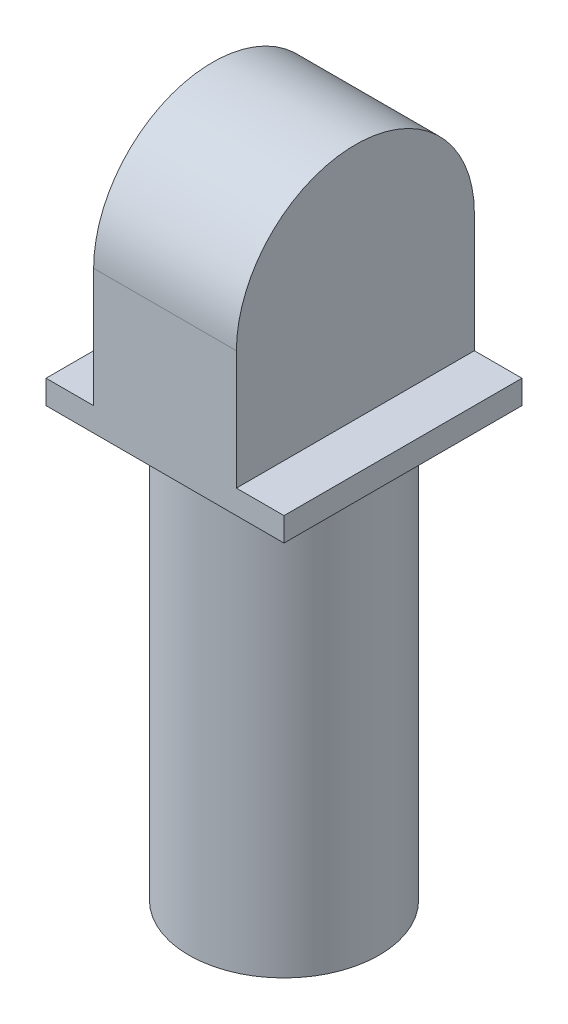
ISO-10303-21;
HEADER;
FILE_DESCRIPTION(('STEP AP214'),'2;1');
FILE_NAME('part.step','',(''),(''),'','','');
FILE_SCHEMA(('AUTOMOTIVE_DESIGN { 1 0 10303 214 1 1 1 1 }'));
ENDSEC;
DATA;
#1=APPLICATION_CONTEXT('core data for automotive mechanical design processes');
#2=APPLICATION_PROTOCOL_DEFINITION('international standard','automotive_design',2000,#1);
#3=PRODUCT_CONTEXT('',#1,'mechanical');
#4=PRODUCT('Part','Part','',(#3));
#5=PRODUCT_RELATED_PRODUCT_CATEGORY('part','',(#4));
#6=PRODUCT_DEFINITION_FORMATION('','',#4);
#7=PRODUCT_DEFINITION_CONTEXT('part definition',#1,'design');
#8=PRODUCT_DEFINITION('design','',#6,#7);
#9=PRODUCT_DEFINITION_SHAPE('','',#8);
#10=(LENGTH_UNIT() NAMED_UNIT(*) SI_UNIT(.MILLI.,.METRE.));
#11=(NAMED_UNIT(*) PLANE_ANGLE_UNIT() SI_UNIT($,.RADIAN.));
#12=(NAMED_UNIT(*) SI_UNIT($,.STERADIAN.) SOLID_ANGLE_UNIT());
#13=UNCERTAINTY_MEASURE_WITH_UNIT(LENGTH_MEASURE(1.E-05),#10,'distance_accuracy_value','');
#14=(GEOMETRIC_REPRESENTATION_CONTEXT(3) GLOBAL_UNCERTAINTY_ASSIGNED_CONTEXT((#13)) GLOBAL_UNIT_ASSIGNED_CONTEXT((#10,
#11,#12)) REPRESENTATION_CONTEXT('',''));
#15=CARTESIAN_POINT('',(0.,0.,0.));
#16=DIRECTION('',(0.,0.,1.));
#17=DIRECTION('',(1.,0.,0.));
#18=AXIS2_PLACEMENT_3D('',#15,#16,#17);
#19=CARTESIAN_POINT('',(-5.,11.,-5.));
#20=DIRECTION('',(0.,0.,1.));
#21=DIRECTION('',(1.,0.,0.));
#22=AXIS2_PLACEMENT_3D('',#19,#20,#21);
#23=PLANE('',#22);
#24=DIRECTION('',(1.,0.,0.));
#25=VECTOR('',#24,1.);
#26=CARTESIAN_POINT('',(-43.,6.,-5.));
#27=LINE('',#26,#25);
#28=CARTESIAN_POINT('',(-3.,6.,-5.));
#29=VERTEX_POINT('',#28);
#30=CARTESIAN_POINT('',(3.,6.,-5.));
#31=VERTEX_POINT('',#30);
#32=EDGE_CURVE('E106',#29,#31,#27,.T.);
#33=ORIENTED_EDGE('',*,*,#32,.T.);
#34=DIRECTION('',(0.,-1.,0.));
#35=VECTOR('',#34,1.);
#36=CARTESIAN_POINT('',(3.,11.,-5.));
#37=LINE('',#36,#35);
#38=CARTESIAN_POINT('',(3.,0.999999999999999,-5.));
#39=VERTEX_POINT('',#38);
#40=EDGE_CURVE('E114',#31,#39,#37,.T.);
#41=ORIENTED_EDGE('',*,*,#40,.T.);
#42=DIRECTION('',(1.,0.,0.));
#43=VECTOR('',#42,1.);
#44=CARTESIAN_POINT('',(-5.,0.999999999999999,-5.));
#45=LINE('',#44,#43);
#46=CARTESIAN_POINT('',(5.,0.999999999999999,-5.));
#47=VERTEX_POINT('',#46);
#48=EDGE_CURVE('E139',#39,#47,#45,.T.);
#49=ORIENTED_EDGE('',*,*,#48,.T.);
#50=DIRECTION('',(0.,-1.,0.));
#51=VECTOR('',#50,1.);
#52=CARTESIAN_POINT('',(5.,11.,-5.));
#53=LINE('',#52,#51);
#54=CARTESIAN_POINT('',(5.,0.,-5.));
#55=VERTEX_POINT('',#54);
#56=EDGE_CURVE('E58',#47,#55,#53,.T.);
#57=ORIENTED_EDGE('',*,*,#56,.T.);
#58=DIRECTION('',(-1.,0.,0.));
#59=VECTOR('',#58,1.);
#60=CARTESIAN_POINT('',(-5.,0.,-5.));
#61=LINE('',#60,#59);
#62=CARTESIAN_POINT('',(-5.,0.,-5.));
#63=VERTEX_POINT('',#62);
#64=EDGE_CURVE('E147',#55,#63,#61,.T.);
#65=ORIENTED_EDGE('',*,*,#64,.T.);
#66=DIRECTION('',(0.,-1.,0.));
#67=VECTOR('',#66,1.);
#68=CARTESIAN_POINT('',(-5.,11.,-5.));
#69=LINE('',#68,#67);
#70=CARTESIAN_POINT('',(-5.,0.999999999999999,-5.));
#71=VERTEX_POINT('',#70);
#72=EDGE_CURVE('E51',#71,#63,#69,.T.);
#73=ORIENTED_EDGE('',*,*,#72,.F.);
#74=DIRECTION('',(1.,0.,0.));
#75=VECTOR('',#74,1.);
#76=CARTESIAN_POINT('',(-5.,0.999999999999999,-5.));
#77=LINE('',#76,#75);
#78=CARTESIAN_POINT('',(-3.,0.999999999999999,-5.));
#79=VERTEX_POINT('',#78);
#80=EDGE_CURVE('E44',#71,#79,#77,.T.);
#81=ORIENTED_EDGE('',*,*,#80,.T.);
#82=DIRECTION('',(0.,1.,0.));
#83=VECTOR('',#82,1.);
#84=CARTESIAN_POINT('',(-3.,11.,-5.));
#85=LINE('',#84,#83);
#86=EDGE_CURVE('E117',#79,#29,#85,.T.);
#87=ORIENTED_EDGE('',*,*,#86,.T.);
#88=EDGE_LOOP('',(#33,#41,#49,#57,#65,#73,#81,#87));
#89=FACE_BOUND('',#88,.T.);
#90=ADVANCED_FACE('F36',(#89),#23,.F.);
#91=CARTESIAN_POINT('',(-5.,11.,5.));
#92=DIRECTION('',(1.,0.,0.));
#93=DIRECTION('',(0.,0.,-1.));
#94=AXIS2_PLACEMENT_3D('',#91,#92,#93);
#95=PLANE('',#94);
#96=DIRECTION('',(0.,-1.,0.));
#97=VECTOR('',#96,1.);
#98=CARTESIAN_POINT('',(-5.,11.,5.));
#99=LINE('',#98,#97);
#100=CARTESIAN_POINT('',(-5.,0.999999999999999,5.));
#101=VERTEX_POINT('',#100);
#102=CARTESIAN_POINT('',(-5.,0.,5.));
#103=VERTEX_POINT('',#102);
#104=EDGE_CURVE('E140',#101,#103,#99,.T.);
#105=ORIENTED_EDGE('',*,*,#104,.F.);
#106=DIRECTION('',(0.,0.,1.));
#107=VECTOR('',#106,1.);
#108=CARTESIAN_POINT('',(-5.,0.999999999999999,-41.));
#109=LINE('',#108,#107);
#110=EDGE_CURVE('E127',#71,#101,#109,.T.);
#111=ORIENTED_EDGE('',*,*,#110,.F.);
#112=ORIENTED_EDGE('',*,*,#72,.T.);
#113=DIRECTION('',(0.,0.,1.));
#114=VECTOR('',#113,1.);
#115=CARTESIAN_POINT('',(-5.,0.,5.));
#116=LINE('',#115,#114);
#117=EDGE_CURVE('E135',#63,#103,#116,.T.);
#118=ORIENTED_EDGE('',*,*,#117,.T.);
#119=EDGE_LOOP('',(#105,#111,#112,#118));
#120=FACE_BOUND('',#119,.T.);
#121=ADVANCED_FACE('F38',(#120),#95,.F.);
#122=CARTESIAN_POINT('',(-5.,11.,5.));
#123=DIRECTION('',(0.,0.,-1.));
#124=DIRECTION('',(-1.,0.,0.));
#125=AXIS2_PLACEMENT_3D('',#122,#123,#124);
#126=PLANE('',#125);
#127=DIRECTION('',(0.,-1.,0.));
#128=VECTOR('',#127,1.);
#129=CARTESIAN_POINT('',(3.,11.,5.));
#130=LINE('',#129,#128);
#131=CARTESIAN_POINT('',(3.,6.,5.));
#132=VERTEX_POINT('',#131);
#133=CARTESIAN_POINT('',(3.,0.999999999999999,5.));
#134=VERTEX_POINT('',#133);
#135=EDGE_CURVE('E168',#132,#134,#130,.T.);
#136=ORIENTED_EDGE('',*,*,#135,.F.);
#137=DIRECTION('',(1.,0.,0.));
#138=VECTOR('',#137,1.);
#139=CARTESIAN_POINT('',(-43.,6.,5.));
#140=LINE('',#139,#138);
#141=CARTESIAN_POINT('',(-3.,6.,5.));
#142=VERTEX_POINT('',#141);
#143=EDGE_CURVE('E109',#142,#132,#140,.T.);
#144=ORIENTED_EDGE('',*,*,#143,.F.);
#145=DIRECTION('',(0.,1.,0.));
#146=VECTOR('',#145,1.);
#147=CARTESIAN_POINT('',(-3.,11.,5.));
#148=LINE('',#147,#146);
#149=CARTESIAN_POINT('',(-3.,0.999999999999999,5.));
#150=VERTEX_POINT('',#149);
#151=EDGE_CURVE('E160',#150,#142,#148,.T.);
#152=ORIENTED_EDGE('',*,*,#151,.F.);
#153=DIRECTION('',(1.,0.,0.));
#154=VECTOR('',#153,1.);
#155=CARTESIAN_POINT('',(-5.,0.999999999999999,5.));
#156=LINE('',#155,#154);
#157=EDGE_CURVE('E163',#101,#150,#156,.T.);
#158=ORIENTED_EDGE('',*,*,#157,.F.);
#159=ORIENTED_EDGE('',*,*,#104,.T.);
#160=DIRECTION('',(1.,0.,0.));
#161=VECTOR('',#160,1.);
#162=CARTESIAN_POINT('',(-5.,0.,5.));
#163=LINE('',#162,#161);
#164=CARTESIAN_POINT('',(5.,0.,5.));
#165=VERTEX_POINT('',#164);
#166=EDGE_CURVE('E142',#103,#165,#163,.T.);
#167=ORIENTED_EDGE('',*,*,#166,.T.);
#168=DIRECTION('',(0.,-1.,0.));
#169=VECTOR('',#168,1.);
#170=CARTESIAN_POINT('',(5.,11.,5.));
#171=LINE('',#170,#169);
#172=CARTESIAN_POINT('',(5.,0.999999999999999,5.));
#173=VERTEX_POINT('',#172);
#174=EDGE_CURVE('E151',#173,#165,#171,.T.);
#175=ORIENTED_EDGE('',*,*,#174,.F.);
#176=DIRECTION('',(1.,0.,0.));
#177=VECTOR('',#176,1.);
#178=CARTESIAN_POINT('',(3.,0.999999999999999,5.));
#179=LINE('',#178,#177);
#180=EDGE_CURVE('E166',#134,#173,#179,.T.);
#181=ORIENTED_EDGE('',*,*,#180,.F.);
#182=EDGE_LOOP('',(#136,#144,#152,#158,#159,#167,#175,#181));
#183=FACE_BOUND('',#182,.T.);
#184=ADVANCED_FACE('F177',(#183),#126,.F.);
#185=CARTESIAN_POINT('',(5.,11.,5.));
#186=DIRECTION('',(-1.,0.,0.));
#187=DIRECTION('',(0.,0.,1.));
#188=AXIS2_PLACEMENT_3D('',#185,#186,#187);
#189=PLANE('',#188);
#190=ORIENTED_EDGE('',*,*,#56,.F.);
#191=DIRECTION('',(0.,0.,1.));
#192=VECTOR('',#191,1.);
#193=CARTESIAN_POINT('',(5.,0.999999999999999,-41.));
#194=LINE('',#193,#192);
#195=EDGE_CURVE('E130',#47,#173,#194,.T.);
#196=ORIENTED_EDGE('',*,*,#195,.T.);
#197=ORIENTED_EDGE('',*,*,#174,.T.);
#198=DIRECTION('',(0.,0.,-1.));
#199=VECTOR('',#198,1.);
#200=CARTESIAN_POINT('',(5.,0.,5.));
#201=LINE('',#200,#199);
#202=EDGE_CURVE('E145',#165,#55,#201,.T.);
#203=ORIENTED_EDGE('',*,*,#202,.T.);
#204=EDGE_LOOP('',(#190,#196,#197,#203));
#205=FACE_BOUND('',#204,.T.);
#206=ADVANCED_FACE('F175',(#205),#189,.F.);
#207=CARTESIAN_POINT('',(0.,0.,0.));
#208=DIRECTION('',(0.,-1.,0.));
#209=DIRECTION('',(0.,0.,-1.));
#210=AXIS2_PLACEMENT_3D('',#207,#208,#209);
#211=PLANE('',#210);
#212=CARTESIAN_POINT('',(0.,0.,0.));
#213=DIRECTION('',(0.,-1.,0.));
#214=DIRECTION('',(0.,0.,-1.));
#215=AXIS2_PLACEMENT_3D('',#212,#213,#214);
#216=CIRCLE('',#215,4.);
#217=CARTESIAN_POINT('',(0.,0.,-4.));
#218=VERTEX_POINT('',#217);
#219=EDGE_CURVE('E136',#218,#218,#216,.T.);
#220=ORIENTED_EDGE('',*,*,#219,.F.);
#221=EDGE_LOOP('',(#220));
#222=FACE_BOUND('',#221,.T.);
#223=ORIENTED_EDGE('',*,*,#117,.F.);
#224=ORIENTED_EDGE('',*,*,#64,.F.);
#225=ORIENTED_EDGE('',*,*,#202,.F.);
#226=ORIENTED_EDGE('',*,*,#166,.F.);
#227=EDGE_LOOP('',(#223,#224,#225,#226));
#228=FACE_BOUND('',#227,.T.);
#229=ADVANCED_FACE('F183',(#222,#228),#211,.T.);
#230=CARTESIAN_POINT('',(0.,-18.,0.));
#231=DIRECTION('',(0.,1.,0.));
#232=DIRECTION('',(0.,0.,1.));
#233=AXIS2_PLACEMENT_3D('',#230,#231,#232);
#234=CYLINDRICAL_SURFACE('',#233,4.);
#235=CARTESIAN_POINT('',(0.,-18.,0.));
#236=DIRECTION('',(0.,-1.,0.));
#237=DIRECTION('',(0.,0.,-1.));
#238=AXIS2_PLACEMENT_3D('',#235,#236,#237);
#239=CIRCLE('',#238,4.);
#240=CARTESIAN_POINT('',(0.,-18.,-4.));
#241=VERTEX_POINT('',#240);
#242=EDGE_CURVE('E125',#241,#241,#239,.T.);
#243=ORIENTED_EDGE('',*,*,#242,.F.);
#244=EDGE_LOOP('',(#243));
#245=FACE_BOUND('',#244,.T.);
#246=ORIENTED_EDGE('',*,*,#219,.T.);
#247=EDGE_LOOP('',(#246));
#248=FACE_BOUND('',#247,.T.);
#249=ADVANCED_FACE('F185',(#245,#248),#234,.T.);
#250=CARTESIAN_POINT('',(0.,-18.,0.));
#251=DIRECTION('',(0.,-1.,0.));
#252=DIRECTION('',(0.,0.,-1.));
#253=AXIS2_PLACEMENT_3D('',#250,#251,#252);
#254=PLANE('',#253);
#255=ORIENTED_EDGE('',*,*,#242,.T.);
#256=EDGE_LOOP('',(#255));
#257=FACE_BOUND('',#256,.T.);
#258=ADVANCED_FACE('F192',(#257),#254,.T.);
#259=CARTESIAN_POINT('',(3.,0.999999999999999,-41.));
#260=DIRECTION('',(0.,-1.,0.));
#261=DIRECTION('',(0.,0.,-1.));
#262=AXIS2_PLACEMENT_3D('',#259,#260,#261);
#263=PLANE('',#262);
#264=DIRECTION('',(0.,0.,1.));
#265=VECTOR('',#264,1.);
#266=CARTESIAN_POINT('',(3.,0.999999999999999,-41.));
#267=LINE('',#266,#265);
#268=EDGE_CURVE('E122',#39,#134,#267,.T.);
#269=ORIENTED_EDGE('',*,*,#268,.T.);
#270=ORIENTED_EDGE('',*,*,#180,.T.);
#271=ORIENTED_EDGE('',*,*,#195,.F.);
#272=ORIENTED_EDGE('',*,*,#48,.F.);
#273=EDGE_LOOP('',(#269,#270,#271,#272));
#274=FACE_BOUND('',#273,.T.);
#275=ADVANCED_FACE('F221',(#274),#263,.F.);
#276=CARTESIAN_POINT('',(3.,11.,-41.));
#277=DIRECTION('',(-1.,0.,0.));
#278=DIRECTION('',(0.,-1.,0.));
#279=AXIS2_PLACEMENT_3D('',#276,#277,#278);
#280=PLANE('',#279);
#281=ORIENTED_EDGE('',*,*,#40,.F.);
#282=CARTESIAN_POINT('',(3.,6.,0.));
#283=DIRECTION('',(-1.,0.,0.));
#284=DIRECTION('',(0.,1.,0.));
#285=AXIS2_PLACEMENT_3D('',#282,#283,#284);
#286=CIRCLE('',#285,5.);
#287=EDGE_CURVE('E103',#132,#31,#286,.T.);
#288=ORIENTED_EDGE('',*,*,#287,.F.);
#289=ORIENTED_EDGE('',*,*,#135,.T.);
#290=ORIENTED_EDGE('',*,*,#268,.F.);
#291=EDGE_LOOP('',(#281,#288,#289,#290));
#292=FACE_BOUND('',#291,.T.);
#293=ADVANCED_FACE('F120',(#292),#280,.F.);
#294=CARTESIAN_POINT('',(-5.,0.999999999999999,-41.));
#295=DIRECTION('',(0.,-1.,0.));
#296=DIRECTION('',(0.,0.,-1.));
#297=AXIS2_PLACEMENT_3D('',#294,#295,#296);
#298=PLANE('',#297);
#299=ORIENTED_EDGE('',*,*,#110,.T.);
#300=ORIENTED_EDGE('',*,*,#157,.T.);
#301=DIRECTION('',(0.,0.,1.));
#302=VECTOR('',#301,1.);
#303=CARTESIAN_POINT('',(-3.,0.999999999999999,-41.));
#304=LINE('',#303,#302);
#305=EDGE_CURVE('E123',#79,#150,#304,.T.);
#306=ORIENTED_EDGE('',*,*,#305,.F.);
#307=ORIENTED_EDGE('',*,*,#80,.F.);
#308=EDGE_LOOP('',(#299,#300,#306,#307));
#309=FACE_BOUND('',#308,.T.);
#310=ADVANCED_FACE('F156',(#309),#298,.F.);
#311=CARTESIAN_POINT('',(-3.,11.,-41.));
#312=DIRECTION('',(1.,0.,0.));
#313=DIRECTION('',(0.,1.,0.));
#314=AXIS2_PLACEMENT_3D('',#311,#312,#313);
#315=PLANE('',#314);
#316=CARTESIAN_POINT('',(-3.,6.,0.));
#317=DIRECTION('',(1.,0.,0.));
#318=DIRECTION('',(0.,1.,0.));
#319=AXIS2_PLACEMENT_3D('',#316,#317,#318);
#320=CIRCLE('',#319,5.);
#321=EDGE_CURVE('E11',#142,#29,#320,.F.);
#322=ORIENTED_EDGE('',*,*,#321,.T.);
#323=ORIENTED_EDGE('',*,*,#86,.F.);
#324=ORIENTED_EDGE('',*,*,#305,.T.);
#325=ORIENTED_EDGE('',*,*,#151,.T.);
#326=EDGE_LOOP('',(#322,#323,#324,#325));
#327=FACE_BOUND('',#326,.T.);
#328=ADVANCED_FACE('F237',(#327),#315,.F.);
#329=CARTESIAN_POINT('',(-43.,6.,0.));
#330=DIRECTION('',(1.,0.,0.));
#331=DIRECTION('',(0.,1.,0.));
#332=AXIS2_PLACEMENT_3D('',#329,#330,#331);
#333=CYLINDRICAL_SURFACE('',#332,5.);
#334=ORIENTED_EDGE('',*,*,#287,.T.);
#335=ORIENTED_EDGE('',*,*,#32,.F.);
#336=ORIENTED_EDGE('',*,*,#321,.F.);
#337=ORIENTED_EDGE('',*,*,#143,.T.);
#338=EDGE_LOOP('',(#334,#335,#336,#337));
#339=FACE_BOUND('',#338,.T.);
#340=ADVANCED_FACE('F105',(#339),#333,.T.);
#341=CLOSED_SHELL('',(#90,#121,#184,#206,#229,#249,#258,#275,#293,#310,#328,#340));
#342=MANIFOLD_SOLID_BREP('B2',#341);
#343=ADVANCED_BREP_SHAPE_REPRESENTATION('',(#18,#342),#14);
#344=SHAPE_DEFINITION_REPRESENTATION(#9,#343);
ENDSEC;
END-ISO-10303-21;
